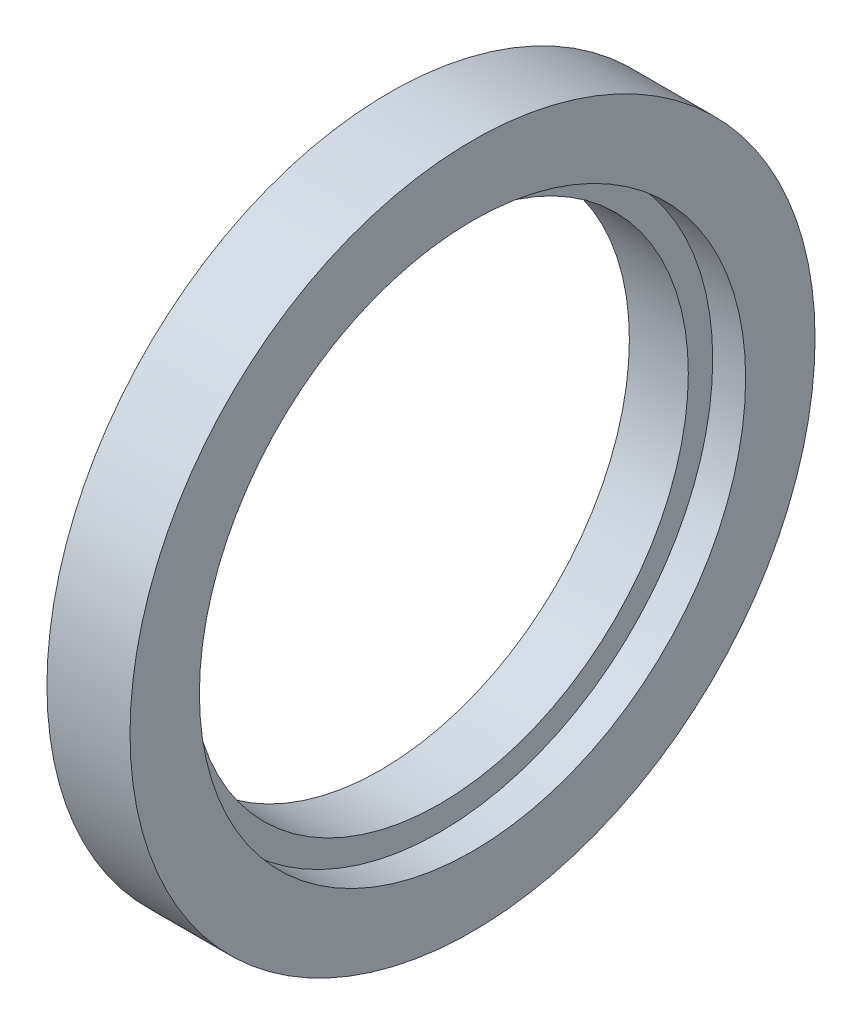
ISO-10303-21;
HEADER;
FILE_DESCRIPTION(('STEP AP214'),'2;1');
FILE_NAME('part.step','',(''),(''),'','','');
FILE_SCHEMA(('AUTOMOTIVE_DESIGN { 1 0 10303 214 1 1 1 1 }'));
ENDSEC;
DATA;
#1=APPLICATION_CONTEXT('core data for automotive mechanical design processes');
#2=APPLICATION_PROTOCOL_DEFINITION('international standard','automotive_design',2000,#1);
#3=PRODUCT_CONTEXT('',#1,'mechanical');
#4=PRODUCT('Part','Part','',(#3));
#5=PRODUCT_RELATED_PRODUCT_CATEGORY('part','',(#4));
#6=PRODUCT_DEFINITION_FORMATION('','',#4);
#7=PRODUCT_DEFINITION_CONTEXT('part definition',#1,'design');
#8=PRODUCT_DEFINITION('design','',#6,#7);
#9=PRODUCT_DEFINITION_SHAPE('','',#8);
#10=(LENGTH_UNIT() NAMED_UNIT(*) SI_UNIT(.MILLI.,.METRE.));
#11=(NAMED_UNIT(*) PLANE_ANGLE_UNIT() SI_UNIT($,.RADIAN.));
#12=(NAMED_UNIT(*) SI_UNIT($,.STERADIAN.) SOLID_ANGLE_UNIT());
#13=UNCERTAINTY_MEASURE_WITH_UNIT(LENGTH_MEASURE(1.E-05),#10,'distance_accuracy_value','');
#14=(GEOMETRIC_REPRESENTATION_CONTEXT(3) GLOBAL_UNCERTAINTY_ASSIGNED_CONTEXT((#13)) GLOBAL_UNIT_ASSIGNED_CONTEXT((#10,
#11,#12)) REPRESENTATION_CONTEXT('',''));
#15=CARTESIAN_POINT('',(0.,0.,0.));
#16=DIRECTION('',(0.,0.,1.));
#17=DIRECTION('',(1.,0.,0.));
#18=AXIS2_PLACEMENT_3D('',#15,#16,#17);
#19=CARTESIAN_POINT('',(2.0692999999999,0.,0.));
#20=DIRECTION('',(1.,0.,0.));
#21=DIRECTION('',(0.,0.,-1.));
#22=AXIS2_PLACEMENT_3D('',#19,#20,#21);
#23=CYLINDRICAL_SURFACE('',#22,17.4624999999999);
#24=CARTESIAN_POINT('',(4.13859999999983,0.,0.));
#25=DIRECTION('',(1.,0.,0.));
#26=DIRECTION('',(0.,0.,-1.));
#27=AXIS2_PLACEMENT_3D('',#24,#25,#26);
#28=CIRCLE('',#27,17.4624999999999);
#29=CARTESIAN_POINT('',(4.13859999999983,0.,-17.4624999999999));
#30=VERTEX_POINT('',#29);
#31=EDGE_CURVE('E17',#30,#30,#28,.F.);
#32=ORIENTED_EDGE('',*,*,#31,.F.);
#33=EDGE_LOOP('',(#32));
#34=FACE_BOUND('',#33,.T.);
#35=CARTESIAN_POINT('',(0.,0.,0.));
#36=DIRECTION('',(1.,0.,0.));
#37=DIRECTION('',(0.,0.,-1.));
#38=AXIS2_PLACEMENT_3D('',#35,#36,#37);
#39=CIRCLE('',#38,17.4624999999999);
#40=CARTESIAN_POINT('',(0.,0.,-17.4624999999999));
#41=VERTEX_POINT('',#40);
#42=EDGE_CURVE('E43',#41,#41,#39,.T.);
#43=ORIENTED_EDGE('',*,*,#42,.F.);
#44=EDGE_LOOP('',(#43));
#45=FACE_BOUND('',#44,.T.);
#46=ADVANCED_FACE('F14',(#34,#45),#23,.F.);
#47=CARTESIAN_POINT('',(4.13859999999983,18.3197499999999,0.));
#48=DIRECTION('',(1.,0.,0.));
#49=DIRECTION('',(0.,0.,-1.));
#50=AXIS2_PLACEMENT_3D('',#47,#48,#49);
#51=PLANE('',#50);
#52=ORIENTED_EDGE('',*,*,#31,.T.);
#53=EDGE_LOOP('',(#52));
#54=FACE_BOUND('',#53,.T.);
#55=CARTESIAN_POINT('',(4.13859999999983,0.,0.));
#56=DIRECTION('',(1.,0.,0.));
#57=DIRECTION('',(0.,0.,-1.));
#58=AXIS2_PLACEMENT_3D('',#55,#56,#57);
#59=CIRCLE('',#58,19.1769999999999);
#60=CARTESIAN_POINT('',(4.13859999999983,0.,-19.1769999999999));
#61=VERTEX_POINT('',#60);
#62=EDGE_CURVE('E41',#61,#61,#59,.T.);
#63=ORIENTED_EDGE('',*,*,#62,.T.);
#64=EDGE_LOOP('',(#63));
#65=FACE_BOUND('',#64,.T.);
#66=ADVANCED_FACE('F50',(#54,#65),#51,.T.);
#67=CARTESIAN_POINT('',(0.,19.2062500000005,0.));
#68=DIRECTION('',(-1.,0.,0.));
#69=DIRECTION('',(0.,0.,1.));
#70=AXIS2_PLACEMENT_3D('',#67,#68,#69);
#71=PLANE('',#70);
#72=ORIENTED_EDGE('',*,*,#42,.T.);
#73=EDGE_LOOP('',(#72));
#74=FACE_BOUND('',#73,.T.);
#75=CARTESIAN_POINT('',(0.,0.,0.));
#76=DIRECTION('',(1.,0.,0.));
#77=DIRECTION('',(0.,0.,-1.));
#78=AXIS2_PLACEMENT_3D('',#75,#76,#77);
#79=CIRCLE('',#78,20.950000000001);
#80=CARTESIAN_POINT('',(0.,0.,-20.950000000001));
#81=VERTEX_POINT('',#80);
#82=EDGE_CURVE('E38',#81,#81,#79,.F.);
#83=ORIENTED_EDGE('',*,*,#82,.T.);
#84=EDGE_LOOP('',(#83));
#85=FACE_BOUND('',#84,.T.);
#86=ADVANCED_FACE('F61',(#74,#85),#71,.T.);
#87=CARTESIAN_POINT('',(5.29429999999922,0.,0.));
#88=DIRECTION('',(1.,0.,0.));
#89=DIRECTION('',(0.,0.,-1.));
#90=AXIS2_PLACEMENT_3D('',#87,#88,#89);
#91=CYLINDRICAL_SURFACE('',#90,19.1769999999999);
#92=CARTESIAN_POINT('',(6.44999999999861,0.,0.));
#93=DIRECTION('',(1.,0.,0.));
#94=DIRECTION('',(0.,0.,-1.));
#95=AXIS2_PLACEMENT_3D('',#92,#93,#94);
#96=CIRCLE('',#95,19.1769999999999);
#97=CARTESIAN_POINT('',(6.44999999999861,0.,-19.1769999999999));
#98=VERTEX_POINT('',#97);
#99=EDGE_CURVE('E33',#98,#98,#96,.F.);
#100=ORIENTED_EDGE('',*,*,#99,.F.);
#101=EDGE_LOOP('',(#100));
#102=FACE_BOUND('',#101,.T.);
#103=ORIENTED_EDGE('',*,*,#62,.F.);
#104=EDGE_LOOP('',(#103));
#105=FACE_BOUND('',#104,.T.);
#106=ADVANCED_FACE('F81',(#102,#105),#91,.F.);
#107=CARTESIAN_POINT('',(-0.255000000000098,0.,0.));
#108=DIRECTION('',(1.,0.,0.));
#109=DIRECTION('',(0.,0.,-1.));
#110=AXIS2_PLACEMENT_3D('',#107,#108,#109);
#111=CYLINDRICAL_SURFACE('',#110,20.950000000001);
#112=ORIENTED_EDGE('',*,*,#82,.F.);
#113=EDGE_LOOP('',(#112));
#114=FACE_BOUND('',#113,.T.);
#115=CARTESIAN_POINT('',(-0.510000002164026,0.,0.));
#116=DIRECTION('',(1.,0.,0.));
#117=DIRECTION('',(0.,1.,0.));
#118=AXIS2_PLACEMENT_3D('',#115,#116,#117);
#119=CIRCLE('',#118,20.9500000007886);
#120=CARTESIAN_POINT('',(-0.510000002164026,20.9500000007886,0.));
#121=VERTEX_POINT('',#120);
#122=EDGE_CURVE('E26',#121,#121,#119,.T.);
#123=ORIENTED_EDGE('',*,*,#122,.F.);
#124=EDGE_LOOP('',(#123));
#125=FACE_BOUND('',#124,.T.);
#126=ADVANCED_FACE('F77',(#114,#125),#111,.F.);
#127=CARTESIAN_POINT('',(6.44999999999861,21.6135000000001,0.));
#128=DIRECTION('',(1.,0.,0.));
#129=DIRECTION('',(0.,0.,-1.));
#130=AXIS2_PLACEMENT_3D('',#127,#128,#129);
#131=PLANE('',#130);
#132=ORIENTED_EDGE('',*,*,#99,.T.);
#133=EDGE_LOOP('',(#132));
#134=FACE_BOUND('',#133,.T.);
#135=CARTESIAN_POINT('',(6.44999999999861,0.,0.));
#136=DIRECTION('',(1.,0.,0.));
#137=DIRECTION('',(0.,0.,-1.));
#138=AXIS2_PLACEMENT_3D('',#135,#136,#137);
#139=CIRCLE('',#138,24.0500000000003);
#140=CARTESIAN_POINT('',(6.44999999999861,0.,-24.0500000000003));
#141=VERTEX_POINT('',#140);
#142=EDGE_CURVE('E21',#141,#141,#139,.F.);
#143=ORIENTED_EDGE('',*,*,#142,.F.);
#144=EDGE_LOOP('',(#143));
#145=FACE_BOUND('',#144,.T.);
#146=ADVANCED_FACE('F70',(#134,#145),#131,.T.);
#147=CARTESIAN_POINT('',(0.618307728388946,0.,0.));
#148=DIRECTION('',(1.,0.,0.));
#149=DIRECTION('',(0.,0.,-1.));
#150=AXIS2_PLACEMENT_3D('',#147,#148,#149);
#151=CONICAL_SURFACE('',#150,24.0499999992128,1.22173047499991);
#152=ORIENTED_EDGE('',*,*,#122,.T.);
#153=EDGE_LOOP('',(#152));
#154=FACE_BOUND('',#153,.T.);
#155=CARTESIAN_POINT('',(0.618307726225102,0.,0.));
#156=DIRECTION('',(1.,0.,0.));
#157=DIRECTION('',(0.,0.,-1.));
#158=AXIS2_PLACEMENT_3D('',#155,#156,#157);
#159=CIRCLE('',#158,24.0500000000003);
#160=CARTESIAN_POINT('',(0.618307726225102,0.,-24.0500000000003));
#161=VERTEX_POINT('',#160);
#162=EDGE_CURVE('E10',#161,#161,#159,.T.);
#163=ORIENTED_EDGE('',*,*,#162,.F.);
#164=EDGE_LOOP('',(#163));
#165=FACE_BOUND('',#164,.T.);
#166=ADVANCED_FACE('F64',(#154,#165),#151,.T.);
#167=CARTESIAN_POINT('',(3.53415386311184,0.,0.));
#168=DIRECTION('',(1.,0.,0.));
#169=DIRECTION('',(0.,0.,-1.));
#170=AXIS2_PLACEMENT_3D('',#167,#168,#169);
#171=CYLINDRICAL_SURFACE('',#170,24.0500000000003);
#172=ORIENTED_EDGE('',*,*,#162,.T.);
#173=EDGE_LOOP('',(#172));
#174=FACE_BOUND('',#173,.T.);
#175=ORIENTED_EDGE('',*,*,#142,.T.);
#176=EDGE_LOOP('',(#175));
#177=FACE_BOUND('',#176,.T.);
#178=ADVANCED_FACE('F62',(#174,#177),#171,.T.);
#179=CLOSED_SHELL('',(#46,#66,#86,#106,#126,#146,#166,#178));
#180=MANIFOLD_SOLID_BREP('B1',#179);
#181=ADVANCED_BREP_SHAPE_REPRESENTATION('',(#18,#180),#14);
#182=SHAPE_DEFINITION_REPRESENTATION(#9,#181);
ENDSEC;
END-ISO-10303-21;
